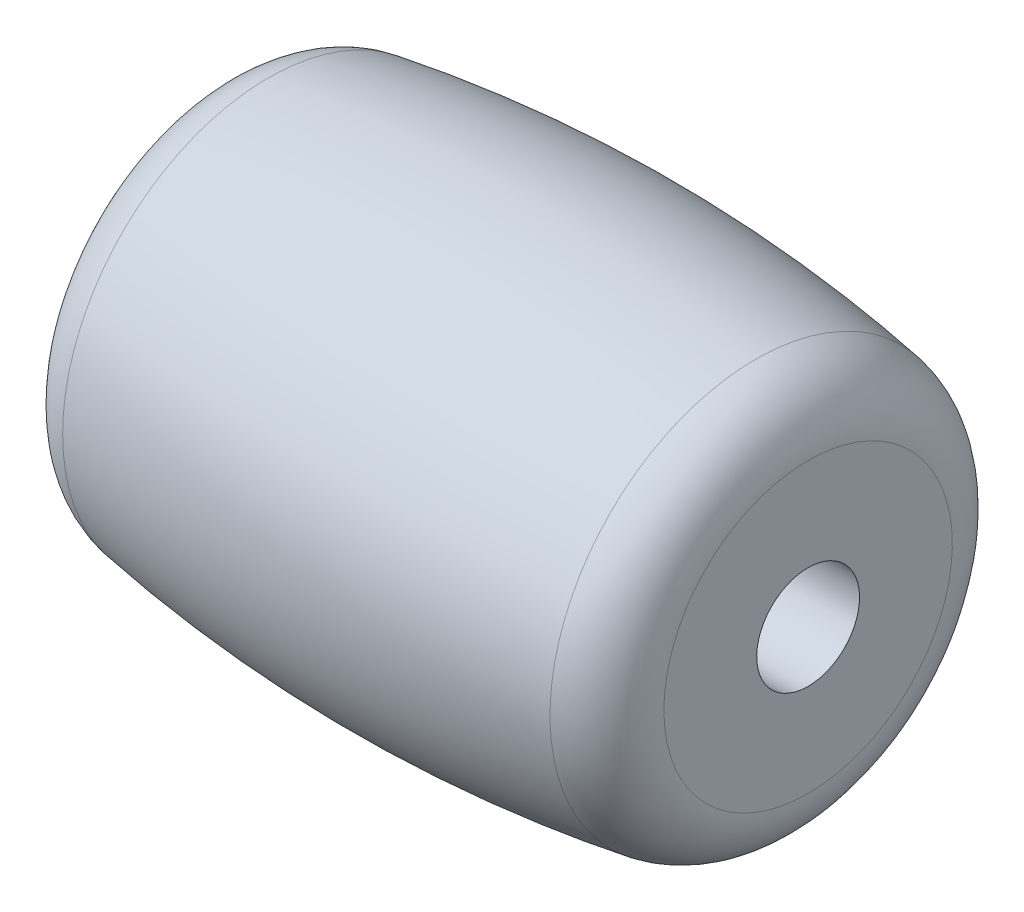
ISO-10303-21;
HEADER;
FILE_DESCRIPTION(('STEP AP214'),'2;1');
FILE_NAME('part.step','',(''),(''),'','','');
FILE_SCHEMA(('AUTOMOTIVE_DESIGN { 1 0 10303 214 1 1 1 1 }'));
ENDSEC;
DATA;
#1=APPLICATION_CONTEXT('core data for automotive mechanical design processes');
#2=APPLICATION_PROTOCOL_DEFINITION('international standard','automotive_design',2000,#1);
#3=PRODUCT_CONTEXT('',#1,'mechanical');
#4=PRODUCT('Part','Part','',(#3));
#5=PRODUCT_RELATED_PRODUCT_CATEGORY('part','',(#4));
#6=PRODUCT_DEFINITION_FORMATION('','',#4);
#7=PRODUCT_DEFINITION_CONTEXT('part definition',#1,'design');
#8=PRODUCT_DEFINITION('design','',#6,#7);
#9=PRODUCT_DEFINITION_SHAPE('','',#8);
#10=(LENGTH_UNIT() NAMED_UNIT(*) SI_UNIT(.MILLI.,.METRE.));
#11=(NAMED_UNIT(*) PLANE_ANGLE_UNIT() SI_UNIT($,.RADIAN.));
#12=(NAMED_UNIT(*) SI_UNIT($,.STERADIAN.) SOLID_ANGLE_UNIT());
#13=UNCERTAINTY_MEASURE_WITH_UNIT(LENGTH_MEASURE(1.E-05),#10,'distance_accuracy_value','');
#14=(GEOMETRIC_REPRESENTATION_CONTEXT(3) GLOBAL_UNCERTAINTY_ASSIGNED_CONTEXT((#13)) GLOBAL_UNIT_ASSIGNED_CONTEXT((#10,
#11,#12)) REPRESENTATION_CONTEXT('',''));
#15=CARTESIAN_POINT('',(0.,0.,0.));
#16=DIRECTION('',(0.,0.,1.));
#17=DIRECTION('',(1.,0.,0.));
#18=AXIS2_PLACEMENT_3D('',#15,#16,#17);
#19=CARTESIAN_POINT('',(9.5,0.,0.));
#20=DIRECTION('',(-1.,0.,0.));
#21=DIRECTION('',(0.,-1.,0.));
#22=AXIS2_PLACEMENT_3D('',#19,#20,#21);
#23=CYLINDRICAL_SURFACE('',#22,1.65);
#24=CARTESIAN_POINT('',(9.5,0.,0.));
#25=DIRECTION('',(-1.,0.,0.));
#26=DIRECTION('',(0.,-1.,0.));
#27=AXIS2_PLACEMENT_3D('',#24,#25,#26);
#28=CIRCLE('',#27,1.65);
#29=CARTESIAN_POINT('',(9.5,-1.65,0.));
#30=VERTEX_POINT('',#29);
#31=EDGE_CURVE('E19',#30,#30,#28,.F.);
#32=ORIENTED_EDGE('',*,*,#31,.T.);
#33=EDGE_LOOP('',(#32));
#34=FACE_BOUND('',#33,.T.);
#35=CARTESIAN_POINT('',(-9.5,0.,0.));
#36=DIRECTION('',(-1.,0.,0.));
#37=DIRECTION('',(0.,-1.,0.));
#38=AXIS2_PLACEMENT_3D('',#35,#36,#37);
#39=CIRCLE('',#38,1.65);
#40=CARTESIAN_POINT('',(-9.5,-1.65,0.));
#41=VERTEX_POINT('',#40);
#42=EDGE_CURVE('E100',#41,#41,#39,.F.);
#43=ORIENTED_EDGE('',*,*,#42,.F.);
#44=EDGE_LOOP('',(#43));
#45=FACE_BOUND('',#44,.T.);
#46=ADVANCED_FACE('F15',(#34,#45),#23,.F.);
#47=CARTESIAN_POINT('',(9.5,0.,0.));
#48=DIRECTION('',(-1.,0.,0.));
#49=DIRECTION('',(0.,-1.,0.));
#50=AXIS2_PLACEMENT_3D('',#47,#48,#49);
#51=PLANE('',#50);
#52=ORIENTED_EDGE('',*,*,#31,.F.);
#53=EDGE_LOOP('',(#52));
#54=FACE_BOUND('',#53,.T.);
#55=CARTESIAN_POINT('',(9.5,0.,0.));
#56=DIRECTION('',(-1.,0.,0.));
#57=DIRECTION('',(0.,-1.,0.));
#58=AXIS2_PLACEMENT_3D('',#55,#56,#57);
#59=CIRCLE('',#58,4.62756179635231);
#60=CARTESIAN_POINT('',(9.5,-4.62756179635231,0.));
#61=VERTEX_POINT('',#60);
#62=EDGE_CURVE('E63',#61,#61,#59,.T.);
#63=ORIENTED_EDGE('',*,*,#62,.F.);
#64=EDGE_LOOP('',(#63));
#65=FACE_BOUND('',#64,.T.);
#66=ADVANCED_FACE('F69',(#54,#65),#51,.F.);
#67=CARTESIAN_POINT('',(-9.5,0.,0.));
#68=DIRECTION('',(-1.,0.,0.));
#69=DIRECTION('',(0.,-1.,0.));
#70=AXIS2_PLACEMENT_3D('',#67,#68,#69);
#71=PLANE('',#70);
#72=ORIENTED_EDGE('',*,*,#42,.T.);
#73=EDGE_LOOP('',(#72));
#74=FACE_BOUND('',#73,.T.);
#75=CARTESIAN_POINT('',(-9.5,0.,0.));
#76=DIRECTION('',(1.,0.,0.));
#77=DIRECTION('',(0.,1.,0.));
#78=AXIS2_PLACEMENT_3D('',#75,#76,#77);
#79=CIRCLE('',#78,4.6275617963523);
#80=CARTESIAN_POINT('',(-9.5,4.6275617963523,0.));
#81=VERTEX_POINT('',#80);
#82=EDGE_CURVE('E28',#81,#81,#79,.T.);
#83=ORIENTED_EDGE('',*,*,#82,.F.);
#84=EDGE_LOOP('',(#83));
#85=FACE_BOUND('',#84,.T.);
#86=ADVANCED_FACE('F77',(#74,#85),#71,.T.);
#87=CARTESIAN_POINT('',(7.5,0.,0.));
#88=DIRECTION('',(-1.,0.,0.));
#89=DIRECTION('',(0.,0.,1.));
#90=AXIS2_PLACEMENT_3D('',#87,#88,#89);
#91=TOROIDAL_SURFACE('',#90,4.62756179635231,2.);
#92=ORIENTED_EDGE('',*,*,#62,.T.);
#93=EDGE_LOOP('',(#92));
#94=FACE_BOUND('',#93,.T.);
#95=CARTESIAN_POINT('',(7.81924059641924,0.,0.));
#96=DIRECTION('',(1.,0.,0.));
#97=DIRECTION('',(0.,0.,-1.));
#98=AXIS2_PLACEMENT_3D('',#95,#96,#97);
#99=CIRCLE('',#98,6.60191876549387);
#100=CARTESIAN_POINT('',(7.81924059641924,0.,-6.60191876549387));
#101=VERTEX_POINT('',#100);
#102=EDGE_CURVE('E23',#101,#101,#99,.T.);
#103=ORIENTED_EDGE('',*,*,#102,.T.);
#104=EDGE_LOOP('',(#103));
#105=FACE_BOUND('',#104,.T.);
#106=ADVANCED_FACE('F44',(#94,#105),#91,.T.);
#107=CARTESIAN_POINT('',(-7.5,0.,0.));
#108=DIRECTION('',(-1.,0.,0.));
#109=DIRECTION('',(0.,0.,1.));
#110=AXIS2_PLACEMENT_3D('',#107,#108,#109);
#111=TOROIDAL_SURFACE('',#110,4.6275617963523,2.);
#112=CARTESIAN_POINT('',(-7.81924059641925,0.,0.));
#113=DIRECTION('',(-1.,0.,0.));
#114=DIRECTION('',(0.,0.,1.));
#115=AXIS2_PLACEMENT_3D('',#112,#113,#114);
#116=CIRCLE('',#115,6.60191876549387);
#117=CARTESIAN_POINT('',(-7.81924059641925,0.,6.60191876549387));
#118=VERTEX_POINT('',#117);
#119=EDGE_CURVE('E10',#118,#118,#116,.T.);
#120=ORIENTED_EDGE('',*,*,#119,.T.);
#121=EDGE_LOOP('',(#120));
#122=FACE_BOUND('',#121,.T.);
#123=ORIENTED_EDGE('',*,*,#82,.T.);
#124=EDGE_LOOP('',(#123));
#125=FACE_BOUND('',#124,.T.);
#126=ADVANCED_FACE('F40',(#122,#125),#111,.T.);
#127=CARTESIAN_POINT('',(0.,0.,0.));
#128=DIRECTION('',(-1.,0.,0.));
#129=DIRECTION('',(0.,0.,1.));
#130=AXIS2_PLACEMENT_3D('',#127,#128,#129);
#131=DEGENERATE_TOROIDAL_SURFACE('',#130,41.756505376344,48.986505376344,.F.);
#132=ORIENTED_EDGE('',*,*,#102,.F.);
#133=EDGE_LOOP('',(#132));
#134=FACE_BOUND('',#133,.T.);
#135=ORIENTED_EDGE('',*,*,#119,.F.);
#136=EDGE_LOOP('',(#135));
#137=FACE_BOUND('',#136,.T.);
#138=ADVANCED_FACE('F17',(#134,#137),#131,.F.);
#139=CLOSED_SHELL('',(#46,#66,#86,#106,#126,#138));
#140=MANIFOLD_SOLID_BREP('B1',#139);
#141=ADVANCED_BREP_SHAPE_REPRESENTATION('',(#18,#140),#14);
#142=SHAPE_DEFINITION_REPRESENTATION(#9,#141);
ENDSEC;
END-ISO-10303-21;
